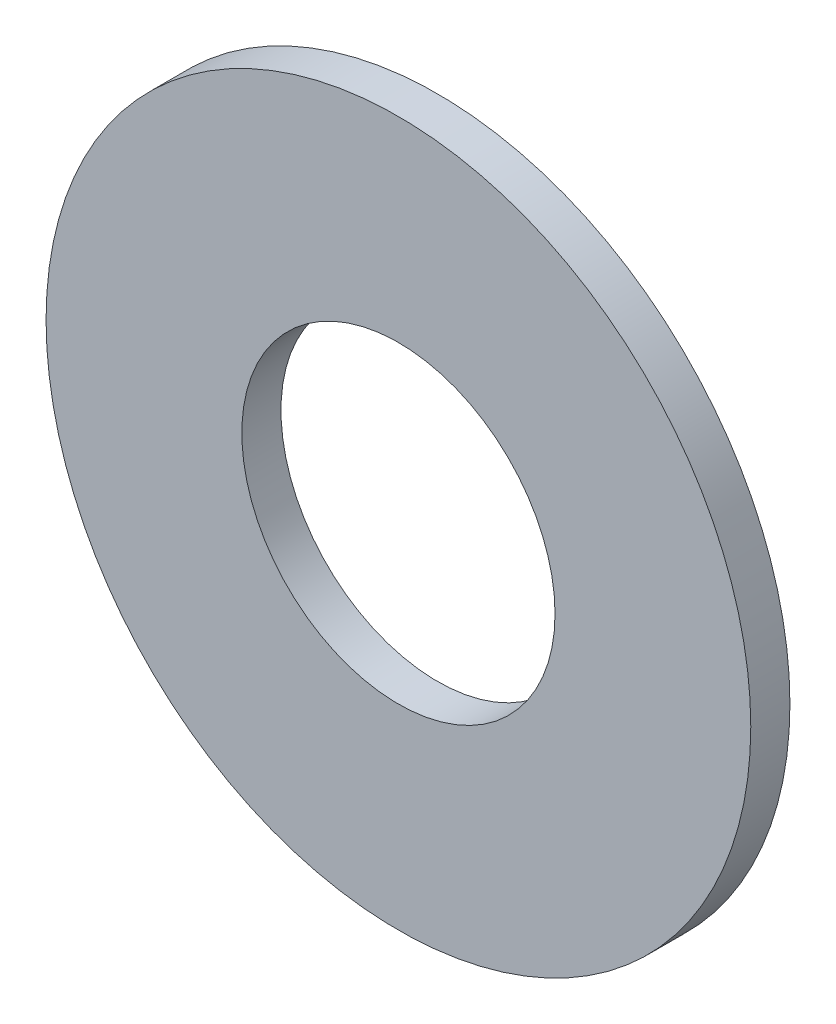
ISO-10303-21;
HEADER;
FILE_DESCRIPTION(('STEP AP214'),'2;1');
FILE_NAME('part.step','',(''),(''),'','','');
FILE_SCHEMA(('AUTOMOTIVE_DESIGN { 1 0 10303 214 1 1 1 1 }'));
ENDSEC;
DATA;
#1=APPLICATION_CONTEXT('core data for automotive mechanical design processes');
#2=APPLICATION_PROTOCOL_DEFINITION('international standard','automotive_design',2000,#1);
#3=PRODUCT_CONTEXT('',#1,'mechanical');
#4=PRODUCT('Part','Part','',(#3));
#5=PRODUCT_RELATED_PRODUCT_CATEGORY('part','',(#4));
#6=PRODUCT_DEFINITION_FORMATION('','',#4);
#7=PRODUCT_DEFINITION_CONTEXT('part definition',#1,'design');
#8=PRODUCT_DEFINITION('design','',#6,#7);
#9=PRODUCT_DEFINITION_SHAPE('','',#8);
#10=(LENGTH_UNIT() NAMED_UNIT(*) SI_UNIT(.MILLI.,.METRE.));
#11=(NAMED_UNIT(*) PLANE_ANGLE_UNIT() SI_UNIT($,.RADIAN.));
#12=(NAMED_UNIT(*) SI_UNIT($,.STERADIAN.) SOLID_ANGLE_UNIT());
#13=UNCERTAINTY_MEASURE_WITH_UNIT(LENGTH_MEASURE(1.E-05),#10,'distance_accuracy_value','');
#14=(GEOMETRIC_REPRESENTATION_CONTEXT(3) GLOBAL_UNCERTAINTY_ASSIGNED_CONTEXT((#13)) GLOBAL_UNIT_ASSIGNED_CONTEXT((#10,
#11,#12)) REPRESENTATION_CONTEXT('',''));
#15=CARTESIAN_POINT('',(0.,0.,0.));
#16=DIRECTION('',(0.,0.,1.));
#17=DIRECTION('',(1.,0.,0.));
#18=AXIS2_PLACEMENT_3D('',#15,#16,#17);
#19=CARTESIAN_POINT('',(0.,0.,0.5));
#20=DIRECTION('',(0.,0.,1.));
#21=DIRECTION('',(1.,0.,0.));
#22=AXIS2_PLACEMENT_3D('',#19,#20,#21);
#23=PLANE('',#22);
#24=CARTESIAN_POINT('',(0.,0.,0.5));
#25=DIRECTION('',(0.,0.,1.));
#26=DIRECTION('',(1.,0.,0.));
#27=AXIS2_PLACEMENT_3D('',#24,#25,#26);
#28=CIRCLE('',#27,4.5);
#29=CARTESIAN_POINT('',(4.5,0.,0.5));
#30=VERTEX_POINT('',#29);
#31=EDGE_CURVE('E10',#30,#30,#28,.T.);
#32=ORIENTED_EDGE('',*,*,#31,.T.);
#33=EDGE_LOOP('',(#32));
#34=FACE_BOUND('',#33,.T.);
#35=CARTESIAN_POINT('',(0.,0.,0.5));
#36=DIRECTION('',(0.,0.,1.));
#37=DIRECTION('',(1.,0.,0.));
#38=AXIS2_PLACEMENT_3D('',#35,#36,#37);
#39=CIRCLE('',#38,2.);
#40=CARTESIAN_POINT('',(2.,0.,0.5));
#41=VERTEX_POINT('',#40);
#42=EDGE_CURVE('E42',#41,#41,#39,.T.);
#43=ORIENTED_EDGE('',*,*,#42,.F.);
#44=EDGE_LOOP('',(#43));
#45=FACE_BOUND('',#44,.T.);
#46=ADVANCED_FACE('F31',(#34,#45),#23,.T.);
#47=CARTESIAN_POINT('',(0.,0.,0.));
#48=DIRECTION('',(0.,0.,1.));
#49=DIRECTION('',(1.,0.,0.));
#50=AXIS2_PLACEMENT_3D('',#47,#48,#49);
#51=PLANE('',#50);
#52=CARTESIAN_POINT('',(0.,0.,0.));
#53=DIRECTION('',(0.,0.,1.));
#54=DIRECTION('',(1.,0.,0.));
#55=AXIS2_PLACEMENT_3D('',#52,#53,#54);
#56=CIRCLE('',#55,4.5);
#57=CARTESIAN_POINT('',(4.5,0.,0.));
#58=VERTEX_POINT('',#57);
#59=EDGE_CURVE('E35',#58,#58,#56,.T.);
#60=ORIENTED_EDGE('',*,*,#59,.F.);
#61=EDGE_LOOP('',(#60));
#62=FACE_BOUND('',#61,.T.);
#63=CARTESIAN_POINT('',(0.,0.,0.));
#64=DIRECTION('',(0.,0.,1.));
#65=DIRECTION('',(1.,0.,0.));
#66=AXIS2_PLACEMENT_3D('',#63,#64,#65);
#67=CIRCLE('',#66,2.);
#68=CARTESIAN_POINT('',(2.,0.,0.));
#69=VERTEX_POINT('',#68);
#70=EDGE_CURVE('E44',#69,#69,#67,.T.);
#71=ORIENTED_EDGE('',*,*,#70,.T.);
#72=EDGE_LOOP('',(#71));
#73=FACE_BOUND('',#72,.T.);
#74=ADVANCED_FACE('F54',(#62,#73),#51,.F.);
#75=CARTESIAN_POINT('',(0.,0.,0.5));
#76=DIRECTION('',(0.,0.,-1.));
#77=DIRECTION('',(-1.,0.,0.));
#78=AXIS2_PLACEMENT_3D('',#75,#76,#77);
#79=CYLINDRICAL_SURFACE('',#78,4.5);
#80=ORIENTED_EDGE('',*,*,#31,.F.);
#81=EDGE_LOOP('',(#80));
#82=FACE_BOUND('',#81,.T.);
#83=ORIENTED_EDGE('',*,*,#59,.T.);
#84=EDGE_LOOP('',(#83));
#85=FACE_BOUND('',#84,.T.);
#86=ADVANCED_FACE('F33',(#82,#85),#79,.T.);
#87=CARTESIAN_POINT('',(0.,0.,0.5));
#88=DIRECTION('',(0.,0.,-1.));
#89=DIRECTION('',(-1.,0.,0.));
#90=AXIS2_PLACEMENT_3D('',#87,#88,#89);
#91=CYLINDRICAL_SURFACE('',#90,2.);
#92=ORIENTED_EDGE('',*,*,#42,.T.);
#93=EDGE_LOOP('',(#92));
#94=FACE_BOUND('',#93,.T.);
#95=ORIENTED_EDGE('',*,*,#70,.F.);
#96=EDGE_LOOP('',(#95));
#97=FACE_BOUND('',#96,.T.);
#98=ADVANCED_FACE('F50',(#94,#97),#91,.F.);
#99=CLOSED_SHELL('',(#46,#74,#86,#98));
#100=MANIFOLD_SOLID_BREP('B2',#99);
#101=ADVANCED_BREP_SHAPE_REPRESENTATION('',(#18,#100),#14);
#102=SHAPE_DEFINITION_REPRESENTATION(#9,#101);
ENDSEC;
END-ISO-10303-21;
